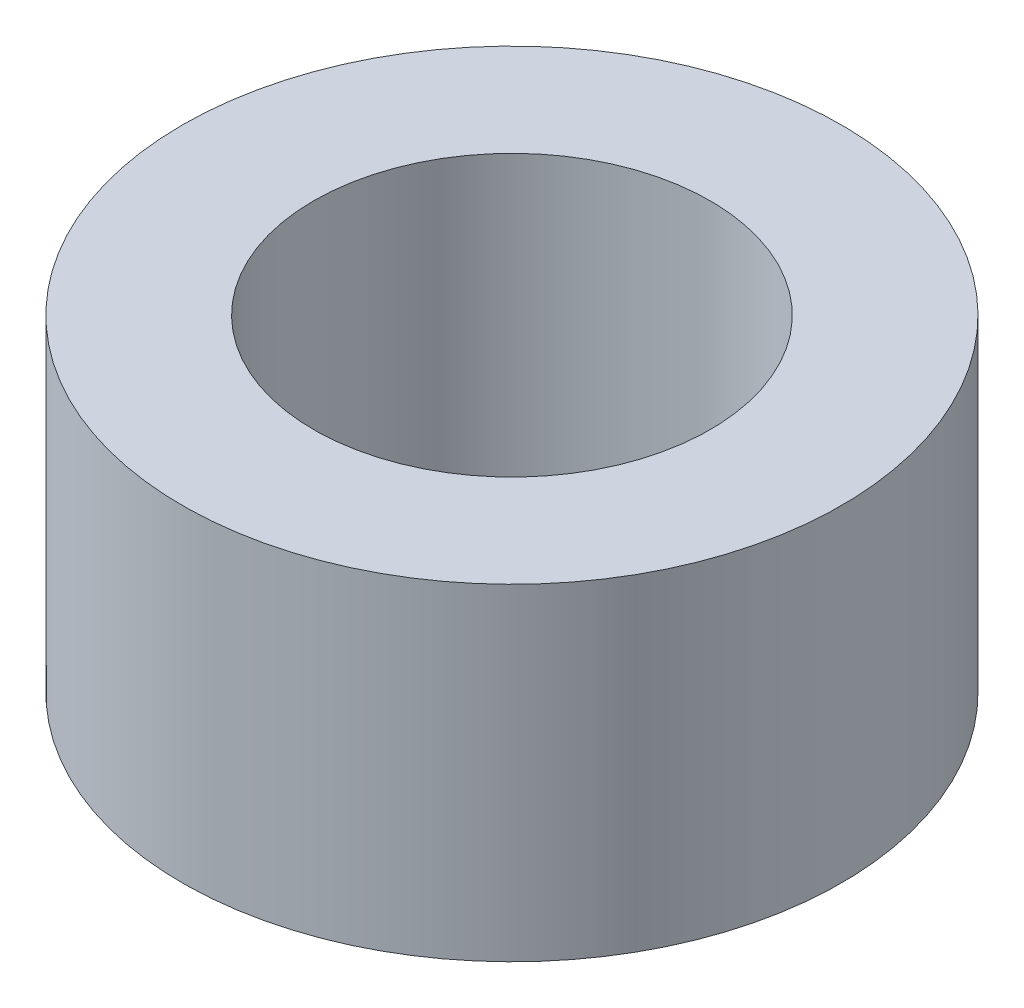
ISO-10303-21;
HEADER;
FILE_DESCRIPTION(('STEP AP214'),'2;1');
FILE_NAME('part.step','',(''),(''),'','','');
FILE_SCHEMA(('AUTOMOTIVE_DESIGN { 1 0 10303 214 1 1 1 1 }'));
ENDSEC;
DATA;
#1=APPLICATION_CONTEXT('core data for automotive mechanical design processes');
#2=APPLICATION_PROTOCOL_DEFINITION('international standard','automotive_design',2000,#1);
#3=PRODUCT_CONTEXT('',#1,'mechanical');
#4=PRODUCT('Part','Part','',(#3));
#5=PRODUCT_RELATED_PRODUCT_CATEGORY('part','',(#4));
#6=PRODUCT_DEFINITION_FORMATION('','',#4);
#7=PRODUCT_DEFINITION_CONTEXT('part definition',#1,'design');
#8=PRODUCT_DEFINITION('design','',#6,#7);
#9=PRODUCT_DEFINITION_SHAPE('','',#8);
#10=(LENGTH_UNIT() NAMED_UNIT(*) SI_UNIT(.MILLI.,.METRE.));
#11=(NAMED_UNIT(*) PLANE_ANGLE_UNIT() SI_UNIT($,.RADIAN.));
#12=(NAMED_UNIT(*) SI_UNIT($,.STERADIAN.) SOLID_ANGLE_UNIT());
#13=UNCERTAINTY_MEASURE_WITH_UNIT(LENGTH_MEASURE(1.E-05),#10,'distance_accuracy_value','');
#14=(GEOMETRIC_REPRESENTATION_CONTEXT(3) GLOBAL_UNCERTAINTY_ASSIGNED_CONTEXT((#13)) GLOBAL_UNIT_ASSIGNED_CONTEXT((#10,
#11,#12)) REPRESENTATION_CONTEXT('',''));
#15=CARTESIAN_POINT('',(0.,0.,0.));
#16=DIRECTION('',(0.,0.,1.));
#17=DIRECTION('',(1.,0.,0.));
#18=AXIS2_PLACEMENT_3D('',#15,#16,#17);
#19=CARTESIAN_POINT('',(15.0812499999977,8.05032015134238,-15.0812500000023));
#20=DIRECTION('',(0.,-1.,0.));
#21=DIRECTION('',(1.,0.,0.));
#22=AXIS2_PLACEMENT_3D('',#19,#20,#21);
#23=CYLINDRICAL_SURFACE('',#22,3.9687500000021);
#24=CARTESIAN_POINT('',(15.0812499999977,-32.512,-15.0812500000023));
#25=DIRECTION('',(0.,1.,0.));
#26=DIRECTION('',(-1.,0.,0.));
#27=AXIS2_PLACEMENT_3D('',#24,#25,#26);
#28=CIRCLE('',#27,3.9687500000021);
#29=CARTESIAN_POINT('',(11.1124999999956,-32.512,-15.0812500000022));
#30=VERTEX_POINT('',#29);
#31=EDGE_CURVE('E49',#30,#30,#28,.T.);
#32=ORIENTED_EDGE('',*,*,#31,.T.);
#33=EDGE_LOOP('',(#32));
#34=FACE_BOUND('',#33,.T.);
#35=CARTESIAN_POINT('',(15.0812499999977,-28.575,-15.0812500000023));
#36=DIRECTION('',(0.,1.,0.));
#37=DIRECTION('',(-1.,0.,0.));
#38=AXIS2_PLACEMENT_3D('',#35,#36,#37);
#39=CIRCLE('',#38,3.9687500000021);
#40=CARTESIAN_POINT('',(11.1124999999956,-28.575,-15.0812500000022));
#41=VERTEX_POINT('',#40);
#42=EDGE_CURVE('E11',#41,#41,#39,.T.);
#43=ORIENTED_EDGE('',*,*,#42,.F.);
#44=EDGE_LOOP('',(#43));
#45=FACE_BOUND('',#44,.T.);
#46=ADVANCED_FACE('F42',(#34,#45),#23,.T.);
#47=CARTESIAN_POINT('',(15.0812499999977,-32.512,-15.0812500000023));
#48=DIRECTION('',(0.,1.,0.));
#49=DIRECTION('',(-1.,0.,0.));
#50=AXIS2_PLACEMENT_3D('',#47,#48,#49);
#51=PLANE('',#50);
#52=ORIENTED_EDGE('',*,*,#31,.F.);
#53=EDGE_LOOP('',(#52));
#54=FACE_BOUND('',#53,.T.);
#55=CARTESIAN_POINT('',(15.0812499999977,-32.512,-15.0812500000023));
#56=DIRECTION('',(0.,1.,0.));
#57=DIRECTION('',(-1.,0.,0.));
#58=AXIS2_PLACEMENT_3D('',#55,#56,#57);
#59=CIRCLE('',#58,2.3876);
#60=CARTESIAN_POINT('',(12.6936499999977,-32.512,-15.0812500000022));
#61=VERTEX_POINT('',#60);
#62=EDGE_CURVE('E54',#61,#61,#59,.T.);
#63=ORIENTED_EDGE('',*,*,#62,.T.);
#64=EDGE_LOOP('',(#63));
#65=FACE_BOUND('',#64,.T.);
#66=ADVANCED_FACE('F70',(#54,#65),#51,.F.);
#67=CARTESIAN_POINT('',(15.0812499999977,8.05032015134238,-15.0812500000023));
#68=DIRECTION('',(0.,-1.,0.));
#69=DIRECTION('',(1.,0.,0.));
#70=AXIS2_PLACEMENT_3D('',#67,#68,#69);
#71=CYLINDRICAL_SURFACE('',#70,2.3876);
#72=ORIENTED_EDGE('',*,*,#62,.F.);
#73=EDGE_LOOP('',(#72));
#74=FACE_BOUND('',#73,.T.);
#75=CARTESIAN_POINT('',(15.0812499999977,-28.575,-15.0812500000023));
#76=DIRECTION('',(0.,1.,0.));
#77=DIRECTION('',(-1.,0.,0.));
#78=AXIS2_PLACEMENT_3D('',#75,#76,#77);
#79=CIRCLE('',#78,2.3876);
#80=CARTESIAN_POINT('',(12.6936499999977,-28.575,-15.0812500000022));
#81=VERTEX_POINT('',#80);
#82=EDGE_CURVE('E45',#81,#81,#79,.T.);
#83=ORIENTED_EDGE('',*,*,#82,.T.);
#84=EDGE_LOOP('',(#83));
#85=FACE_BOUND('',#84,.T.);
#86=ADVANCED_FACE('F62',(#74,#85),#71,.F.);
#87=CARTESIAN_POINT('',(0.,-28.575,0.));
#88=DIRECTION('',(0.,1.,0.));
#89=DIRECTION('',(-1.,0.,0.));
#90=AXIS2_PLACEMENT_3D('',#87,#88,#89);
#91=PLANE('',#90);
#92=ORIENTED_EDGE('',*,*,#82,.F.);
#93=EDGE_LOOP('',(#92));
#94=FACE_BOUND('',#93,.T.);
#95=ORIENTED_EDGE('',*,*,#42,.T.);
#96=EDGE_LOOP('',(#95));
#97=FACE_BOUND('',#96,.T.);
#98=ADVANCED_FACE('F64',(#94,#97),#91,.T.);
#99=CLOSED_SHELL('',(#46,#66,#86,#98));
#100=MANIFOLD_SOLID_BREP('B2',#99);
#101=ADVANCED_BREP_SHAPE_REPRESENTATION('',(#18,#100),#14);
#102=SHAPE_DEFINITION_REPRESENTATION(#9,#101);
ENDSEC;
END-ISO-10303-21;
